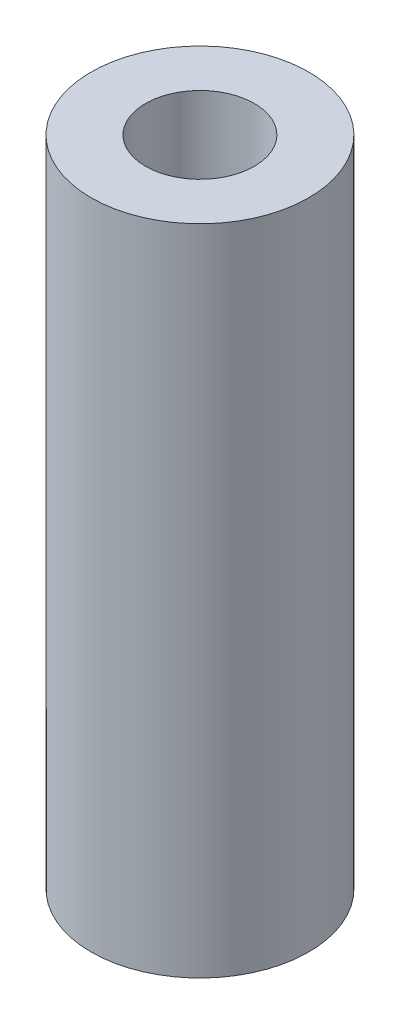
ISO-10303-21;
HEADER;
FILE_DESCRIPTION(('STEP AP214'),'2;1');
FILE_NAME('part.step','',(''),(''),'','','');
FILE_SCHEMA(('AUTOMOTIVE_DESIGN { 1 0 10303 214 1 1 1 1 }'));
ENDSEC;
DATA;
#1=APPLICATION_CONTEXT('core data for automotive mechanical design processes');
#2=APPLICATION_PROTOCOL_DEFINITION('international standard','automotive_design',2000,#1);
#3=PRODUCT_CONTEXT('',#1,'mechanical');
#4=PRODUCT('Part','Part','',(#3));
#5=PRODUCT_RELATED_PRODUCT_CATEGORY('part','',(#4));
#6=PRODUCT_DEFINITION_FORMATION('','',#4);
#7=PRODUCT_DEFINITION_CONTEXT('part definition',#1,'design');
#8=PRODUCT_DEFINITION('design','',#6,#7);
#9=PRODUCT_DEFINITION_SHAPE('','',#8);
#10=(LENGTH_UNIT() NAMED_UNIT(*) SI_UNIT(.MILLI.,.METRE.));
#11=(NAMED_UNIT(*) PLANE_ANGLE_UNIT() SI_UNIT($,.RADIAN.));
#12=(NAMED_UNIT(*) SI_UNIT($,.STERADIAN.) SOLID_ANGLE_UNIT());
#13=UNCERTAINTY_MEASURE_WITH_UNIT(LENGTH_MEASURE(1.E-05),#10,'distance_accuracy_value','');
#14=(GEOMETRIC_REPRESENTATION_CONTEXT(3) GLOBAL_UNCERTAINTY_ASSIGNED_CONTEXT((#13)) GLOBAL_UNIT_ASSIGNED_CONTEXT((#10,
#11,#12)) REPRESENTATION_CONTEXT('',''));
#15=CARTESIAN_POINT('',(0.,0.,0.));
#16=DIRECTION('',(0.,0.,1.));
#17=DIRECTION('',(1.,0.,0.));
#18=AXIS2_PLACEMENT_3D('',#15,#16,#17);
#19=CARTESIAN_POINT('',(0.,18.,0.));
#20=DIRECTION('',(0.,1.,0.));
#21=DIRECTION('',(0.,0.,1.));
#22=AXIS2_PLACEMENT_3D('',#19,#20,#21);
#23=PLANE('',#22);
#24=CARTESIAN_POINT('',(0.,18.,0.));
#25=DIRECTION('',(0.,1.,0.));
#26=DIRECTION('',(0.,0.,1.));
#27=AXIS2_PLACEMENT_3D('',#24,#25,#26);
#28=CIRCLE('',#27,3.);
#29=CARTESIAN_POINT('',(0.,18.,3.));
#30=VERTEX_POINT('',#29);
#31=EDGE_CURVE('E10',#30,#30,#28,.T.);
#32=ORIENTED_EDGE('',*,*,#31,.T.);
#33=EDGE_LOOP('',(#32));
#34=FACE_BOUND('',#33,.T.);
#35=CARTESIAN_POINT('',(0.,18.,0.));
#36=DIRECTION('',(0.,1.,0.));
#37=DIRECTION('',(0.,0.,1.));
#38=AXIS2_PLACEMENT_3D('',#35,#36,#37);
#39=CIRCLE('',#38,1.5);
#40=CARTESIAN_POINT('',(0.,18.,1.5));
#41=VERTEX_POINT('',#40);
#42=EDGE_CURVE('E44',#41,#41,#39,.T.);
#43=ORIENTED_EDGE('',*,*,#42,.F.);
#44=EDGE_LOOP('',(#43));
#45=FACE_BOUND('',#44,.T.);
#46=ADVANCED_FACE('F33',(#34,#45),#23,.T.);
#47=CARTESIAN_POINT('',(0.,0.,0.));
#48=DIRECTION('',(0.,1.,0.));
#49=DIRECTION('',(0.,0.,1.));
#50=AXIS2_PLACEMENT_3D('',#47,#48,#49);
#51=PLANE('',#50);
#52=CARTESIAN_POINT('',(0.,0.,0.));
#53=DIRECTION('',(0.,1.,0.));
#54=DIRECTION('',(0.,0.,1.));
#55=AXIS2_PLACEMENT_3D('',#52,#53,#54);
#56=CIRCLE('',#55,3.);
#57=CARTESIAN_POINT('',(0.,0.,3.));
#58=VERTEX_POINT('',#57);
#59=EDGE_CURVE('E37',#58,#58,#56,.T.);
#60=ORIENTED_EDGE('',*,*,#59,.F.);
#61=EDGE_LOOP('',(#60));
#62=FACE_BOUND('',#61,.T.);
#63=CARTESIAN_POINT('',(0.,0.,0.));
#64=DIRECTION('',(0.,1.,0.));
#65=DIRECTION('',(0.,0.,1.));
#66=AXIS2_PLACEMENT_3D('',#63,#64,#65);
#67=CIRCLE('',#66,1.5);
#68=CARTESIAN_POINT('',(0.,0.,1.5));
#69=VERTEX_POINT('',#68);
#70=EDGE_CURVE('E46',#69,#69,#67,.T.);
#71=ORIENTED_EDGE('',*,*,#70,.T.);
#72=EDGE_LOOP('',(#71));
#73=FACE_BOUND('',#72,.T.);
#74=ADVANCED_FACE('F56',(#62,#73),#51,.F.);
#75=CARTESIAN_POINT('',(0.,18.,0.));
#76=DIRECTION('',(0.,-1.,0.));
#77=DIRECTION('',(0.,0.,-1.));
#78=AXIS2_PLACEMENT_3D('',#75,#76,#77);
#79=CYLINDRICAL_SURFACE('',#78,3.);
#80=ORIENTED_EDGE('',*,*,#31,.F.);
#81=EDGE_LOOP('',(#80));
#82=FACE_BOUND('',#81,.T.);
#83=ORIENTED_EDGE('',*,*,#59,.T.);
#84=EDGE_LOOP('',(#83));
#85=FACE_BOUND('',#84,.T.);
#86=ADVANCED_FACE('F35',(#82,#85),#79,.T.);
#87=CARTESIAN_POINT('',(0.,18.,0.));
#88=DIRECTION('',(0.,-1.,0.));
#89=DIRECTION('',(0.,0.,-1.));
#90=AXIS2_PLACEMENT_3D('',#87,#88,#89);
#91=CYLINDRICAL_SURFACE('',#90,1.5);
#92=ORIENTED_EDGE('',*,*,#42,.T.);
#93=EDGE_LOOP('',(#92));
#94=FACE_BOUND('',#93,.T.);
#95=ORIENTED_EDGE('',*,*,#70,.F.);
#96=EDGE_LOOP('',(#95));
#97=FACE_BOUND('',#96,.T.);
#98=ADVANCED_FACE('F52',(#94,#97),#91,.F.);
#99=CLOSED_SHELL('',(#46,#74,#86,#98));
#100=MANIFOLD_SOLID_BREP('B2',#99);
#101=ADVANCED_BREP_SHAPE_REPRESENTATION('',(#18,#100),#14);
#102=SHAPE_DEFINITION_REPRESENTATION(#9,#101);
ENDSEC;
END-ISO-10303-21;
